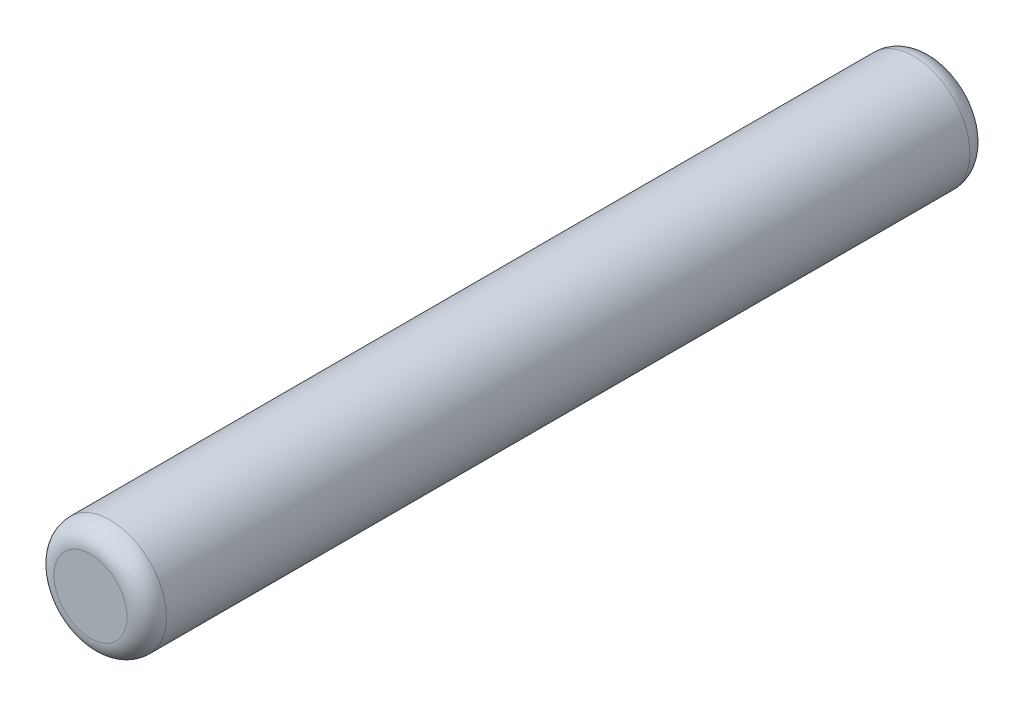
ISO-10303-21;
HEADER;
FILE_DESCRIPTION(('STEP AP214'),'2;1');
FILE_NAME('part.step','',(''),(''),'','','');
FILE_SCHEMA(('AUTOMOTIVE_DESIGN { 1 0 10303 214 1 1 1 1 }'));
ENDSEC;
DATA;
#1=APPLICATION_CONTEXT('core data for automotive mechanical design processes');
#2=APPLICATION_PROTOCOL_DEFINITION('international standard','automotive_design',2000,#1);
#3=PRODUCT_CONTEXT('',#1,'mechanical');
#4=PRODUCT('Part','Part','',(#3));
#5=PRODUCT_RELATED_PRODUCT_CATEGORY('part','',(#4));
#6=PRODUCT_DEFINITION_FORMATION('','',#4);
#7=PRODUCT_DEFINITION_CONTEXT('part definition',#1,'design');
#8=PRODUCT_DEFINITION('design','',#6,#7);
#9=PRODUCT_DEFINITION_SHAPE('','',#8);
#10=(LENGTH_UNIT() NAMED_UNIT(*) SI_UNIT(.MILLI.,.METRE.));
#11=(NAMED_UNIT(*) PLANE_ANGLE_UNIT() SI_UNIT($,.RADIAN.));
#12=(NAMED_UNIT(*) SI_UNIT($,.STERADIAN.) SOLID_ANGLE_UNIT());
#13=UNCERTAINTY_MEASURE_WITH_UNIT(LENGTH_MEASURE(1.E-05),#10,'distance_accuracy_value','');
#14=(GEOMETRIC_REPRESENTATION_CONTEXT(3) GLOBAL_UNCERTAINTY_ASSIGNED_CONTEXT((#13)) GLOBAL_UNIT_ASSIGNED_CONTEXT((#10,
#11,#12)) REPRESENTATION_CONTEXT('',''));
#15=CARTESIAN_POINT('',(0.,0.,0.));
#16=DIRECTION('',(0.,0.,1.));
#17=DIRECTION('',(1.,0.,0.));
#18=AXIS2_PLACEMENT_3D('',#15,#16,#17);
#19=CARTESIAN_POINT('',(0.,0.,7.5));
#20=DIRECTION('',(0.,0.,-1.));
#21=DIRECTION('',(-1.,0.,0.));
#22=AXIS2_PLACEMENT_3D('',#19,#20,#21);
#23=CYLINDRICAL_SURFACE('',#22,1.);
#24=CARTESIAN_POINT('',(0.,0.,-7.15));
#25=DIRECTION('',(0.,0.,1.));
#26=DIRECTION('',(1.,0.,0.));
#27=AXIS2_PLACEMENT_3D('',#24,#25,#26);
#28=CIRCLE('',#27,1.);
#29=CARTESIAN_POINT('',(1.,0.,-7.15));
#30=VERTEX_POINT('',#29);
#31=EDGE_CURVE('E42',#30,#30,#28,.T.);
#32=ORIENTED_EDGE('',*,*,#31,.T.);
#33=EDGE_LOOP('',(#32));
#34=FACE_BOUND('',#33,.T.);
#35=CARTESIAN_POINT('',(0.,0.,7.15));
#36=DIRECTION('',(0.,0.,1.));
#37=DIRECTION('',(1.,0.,0.));
#38=AXIS2_PLACEMENT_3D('',#35,#36,#37);
#39=CIRCLE('',#38,1.);
#40=CARTESIAN_POINT('',(1.,0.,7.15));
#41=VERTEX_POINT('',#40);
#42=EDGE_CURVE('E46',#41,#41,#39,.F.);
#43=ORIENTED_EDGE('',*,*,#42,.T.);
#44=EDGE_LOOP('',(#43));
#45=FACE_BOUND('',#44,.T.);
#46=ADVANCED_FACE('F31',(#34,#45),#23,.T.);
#47=CARTESIAN_POINT('',(0.,0.,7.5));
#48=DIRECTION('',(0.,0.,1.));
#49=DIRECTION('',(1.,0.,0.));
#50=AXIS2_PLACEMENT_3D('',#47,#48,#49);
#51=PLANE('',#50);
#52=CARTESIAN_POINT('',(0.,0.,7.5));
#53=DIRECTION('',(0.,0.,1.));
#54=DIRECTION('',(1.,0.,0.));
#55=AXIS2_PLACEMENT_3D('',#52,#53,#54);
#56=CIRCLE('',#55,0.65);
#57=CARTESIAN_POINT('',(0.65,0.,7.5));
#58=VERTEX_POINT('',#57);
#59=EDGE_CURVE('E10',#58,#58,#56,.T.);
#60=ORIENTED_EDGE('',*,*,#59,.T.);
#61=EDGE_LOOP('',(#60));
#62=FACE_BOUND('',#61,.T.);
#63=ADVANCED_FACE('F62',(#62),#51,.T.);
#64=CARTESIAN_POINT('',(0.,0.,-7.5));
#65=DIRECTION('',(0.,0.,1.));
#66=DIRECTION('',(1.,0.,0.));
#67=AXIS2_PLACEMENT_3D('',#64,#65,#66);
#68=PLANE('',#67);
#69=CARTESIAN_POINT('',(0.,0.,-7.5));
#70=DIRECTION('',(0.,0.,1.));
#71=DIRECTION('',(1.,0.,0.));
#72=AXIS2_PLACEMENT_3D('',#69,#70,#71);
#73=CIRCLE('',#72,0.65);
#74=CARTESIAN_POINT('',(0.65,0.,-7.5));
#75=VERTEX_POINT('',#74);
#76=EDGE_CURVE('E38',#75,#75,#73,.F.);
#77=ORIENTED_EDGE('',*,*,#76,.T.);
#78=EDGE_LOOP('',(#77));
#79=FACE_BOUND('',#78,.T.);
#80=ADVANCED_FACE('F59',(#79),#68,.F.);
#81=CARTESIAN_POINT('',(0.,0.,-7.15));
#82=DIRECTION('',(0.,0.,1.));
#83=DIRECTION('',(1.,0.,0.));
#84=AXIS2_PLACEMENT_3D('',#81,#82,#83);
#85=TOROIDAL_SURFACE('',#84,0.65,0.35);
#86=ORIENTED_EDGE('',*,*,#76,.F.);
#87=EDGE_LOOP('',(#86));
#88=FACE_BOUND('',#87,.T.);
#89=ORIENTED_EDGE('',*,*,#31,.F.);
#90=EDGE_LOOP('',(#89));
#91=FACE_BOUND('',#90,.T.);
#92=ADVANCED_FACE('F55',(#88,#91),#85,.T.);
#93=CARTESIAN_POINT('',(0.,0.,7.15));
#94=DIRECTION('',(0.,0.,1.));
#95=DIRECTION('',(1.,0.,0.));
#96=AXIS2_PLACEMENT_3D('',#93,#94,#95);
#97=TOROIDAL_SURFACE('',#96,0.65,0.35);
#98=ORIENTED_EDGE('',*,*,#42,.F.);
#99=EDGE_LOOP('',(#98));
#100=FACE_BOUND('',#99,.T.);
#101=ORIENTED_EDGE('',*,*,#59,.F.);
#102=EDGE_LOOP('',(#101));
#103=FACE_BOUND('',#102,.T.);
#104=ADVANCED_FACE('F33',(#100,#103),#97,.T.);
#105=CLOSED_SHELL('',(#46,#63,#80,#92,#104));
#106=MANIFOLD_SOLID_BREP('B2',#105);
#107=ADVANCED_BREP_SHAPE_REPRESENTATION('',(#18,#106),#14);
#108=SHAPE_DEFINITION_REPRESENTATION(#9,#107);
ENDSEC;
END-ISO-10303-21;
